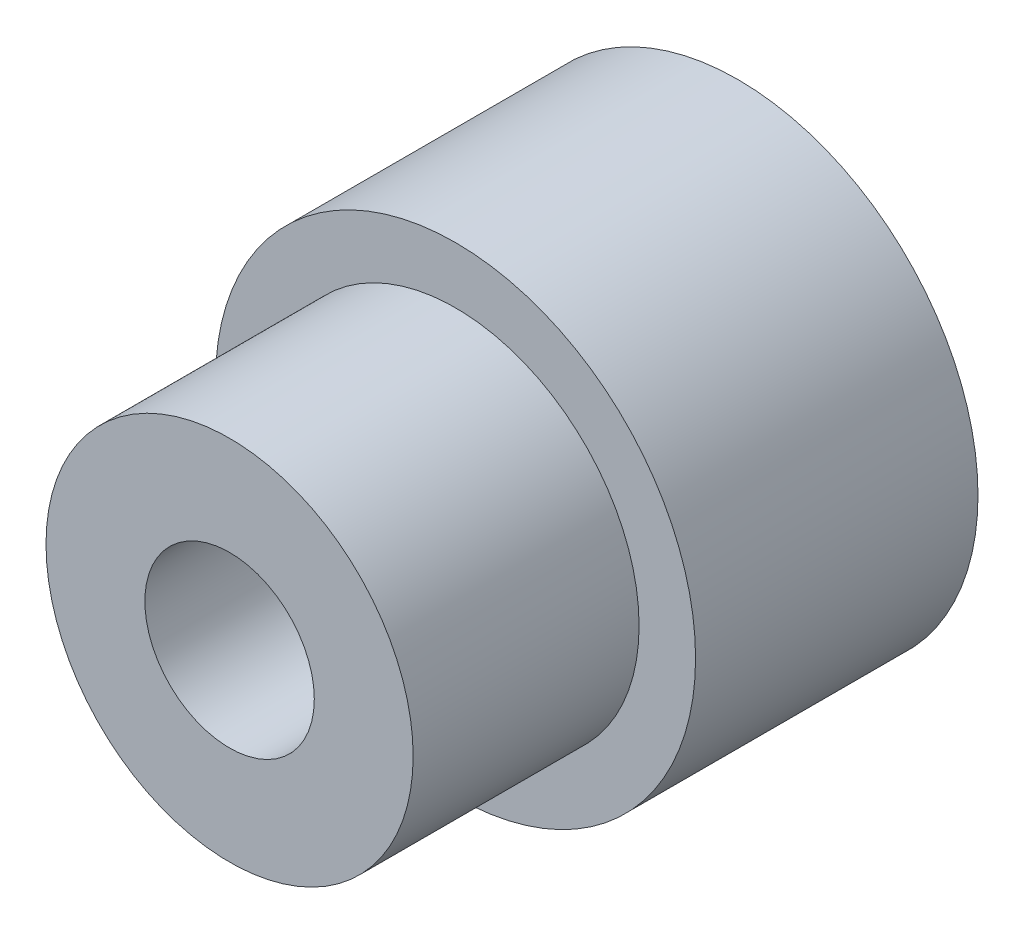
ISO-10303-21;
HEADER;
FILE_DESCRIPTION(('STEP AP214'),'2;1');
FILE_NAME('part.step','',(''),(''),'','','');
FILE_SCHEMA(('AUTOMOTIVE_DESIGN { 1 0 10303 214 1 1 1 1 }'));
ENDSEC;
DATA;
#1=APPLICATION_CONTEXT('core data for automotive mechanical design processes');
#2=APPLICATION_PROTOCOL_DEFINITION('international standard','automotive_design',2000,#1);
#3=PRODUCT_CONTEXT('',#1,'mechanical');
#4=PRODUCT('Part','Part','',(#3));
#5=PRODUCT_RELATED_PRODUCT_CATEGORY('part','',(#4));
#6=PRODUCT_DEFINITION_FORMATION('','',#4);
#7=PRODUCT_DEFINITION_CONTEXT('part definition',#1,'design');
#8=PRODUCT_DEFINITION('design','',#6,#7);
#9=PRODUCT_DEFINITION_SHAPE('','',#8);
#10=(LENGTH_UNIT() NAMED_UNIT(*) SI_UNIT(.MILLI.,.METRE.));
#11=(NAMED_UNIT(*) PLANE_ANGLE_UNIT() SI_UNIT($,.RADIAN.));
#12=(NAMED_UNIT(*) SI_UNIT($,.STERADIAN.) SOLID_ANGLE_UNIT());
#13=UNCERTAINTY_MEASURE_WITH_UNIT(LENGTH_MEASURE(1.E-05),#10,'distance_accuracy_value','');
#14=(GEOMETRIC_REPRESENTATION_CONTEXT(3) GLOBAL_UNCERTAINTY_ASSIGNED_CONTEXT((#13)) GLOBAL_UNIT_ASSIGNED_CONTEXT((#10,
#11,#12)) REPRESENTATION_CONTEXT('',''));
#15=CARTESIAN_POINT('',(0.,0.,0.));
#16=DIRECTION('',(0.,0.,1.));
#17=DIRECTION('',(1.,0.,0.));
#18=AXIS2_PLACEMENT_3D('',#15,#16,#17);
#19=CARTESIAN_POINT('',(0.,0.,10.));
#20=DIRECTION('',(0.,0.,-1.));
#21=DIRECTION('',(-1.,0.,0.));
#22=AXIS2_PLACEMENT_3D('',#19,#20,#21);
#23=CYLINDRICAL_SURFACE('',#22,8.5);
#24=CARTESIAN_POINT('',(0.,0.,10.));
#25=DIRECTION('',(0.,0.,1.));
#26=DIRECTION('',(1.,0.,0.));
#27=AXIS2_PLACEMENT_3D('',#24,#25,#26);
#28=CIRCLE('',#27,8.5);
#29=CARTESIAN_POINT('',(8.5,0.,10.));
#30=VERTEX_POINT('',#29);
#31=EDGE_CURVE('E10',#30,#30,#28,.T.);
#32=ORIENTED_EDGE('',*,*,#31,.F.);
#33=EDGE_LOOP('',(#32));
#34=FACE_BOUND('',#33,.T.);
#35=CARTESIAN_POINT('',(0.,0.,0.));
#36=DIRECTION('',(0.,0.,1.));
#37=DIRECTION('',(1.,0.,0.));
#38=AXIS2_PLACEMENT_3D('',#35,#36,#37);
#39=CIRCLE('',#38,8.5);
#40=CARTESIAN_POINT('',(8.5,0.,0.));
#41=VERTEX_POINT('',#40);
#42=EDGE_CURVE('E36',#41,#41,#39,.T.);
#43=ORIENTED_EDGE('',*,*,#42,.T.);
#44=EDGE_LOOP('',(#43));
#45=FACE_BOUND('',#44,.T.);
#46=ADVANCED_FACE('F33',(#34,#45),#23,.T.);
#47=CARTESIAN_POINT('',(0.,0.,10.));
#48=DIRECTION('',(0.,0.,1.));
#49=DIRECTION('',(1.,0.,0.));
#50=AXIS2_PLACEMENT_3D('',#47,#48,#49);
#51=PLANE('',#50);
#52=CARTESIAN_POINT('',(0.,0.,10.));
#53=DIRECTION('',(0.,0.,1.));
#54=DIRECTION('',(1.,0.,0.));
#55=AXIS2_PLACEMENT_3D('',#52,#53,#54);
#56=CIRCLE('',#55,6.5);
#57=CARTESIAN_POINT('',(6.5,0.,10.));
#58=VERTEX_POINT('',#57);
#59=EDGE_CURVE('E45',#58,#58,#56,.T.);
#60=ORIENTED_EDGE('',*,*,#59,.F.);
#61=EDGE_LOOP('',(#60));
#62=FACE_BOUND('',#61,.T.);
#63=ORIENTED_EDGE('',*,*,#31,.T.);
#64=EDGE_LOOP('',(#63));
#65=FACE_BOUND('',#64,.T.);
#66=ADVANCED_FACE('F78',(#62,#65),#51,.T.);
#67=CARTESIAN_POINT('',(0.,0.,0.));
#68=DIRECTION('',(0.,0.,1.));
#69=DIRECTION('',(1.,0.,0.));
#70=AXIS2_PLACEMENT_3D('',#67,#68,#69);
#71=PLANE('',#70);
#72=CARTESIAN_POINT('',(0.,0.,0.));
#73=DIRECTION('',(0.,0.,1.));
#74=DIRECTION('',(1.,0.,0.));
#75=AXIS2_PLACEMENT_3D('',#72,#73,#74);
#76=CIRCLE('',#75,3.);
#77=CARTESIAN_POINT('',(3.,0.,0.));
#78=VERTEX_POINT('',#77);
#79=EDGE_CURVE('E48',#78,#78,#76,.T.);
#80=ORIENTED_EDGE('',*,*,#79,.T.);
#81=EDGE_LOOP('',(#80));
#82=FACE_BOUND('',#81,.T.);
#83=ORIENTED_EDGE('',*,*,#42,.F.);
#84=EDGE_LOOP('',(#83));
#85=FACE_BOUND('',#84,.T.);
#86=ADVANCED_FACE('F57',(#82,#85),#71,.F.);
#87=CARTESIAN_POINT('',(0.,0.,18.));
#88=DIRECTION('',(0.,0.,-1.));
#89=DIRECTION('',(-1.,0.,0.));
#90=AXIS2_PLACEMENT_3D('',#87,#88,#89);
#91=CYLINDRICAL_SURFACE('',#90,6.5);
#92=CARTESIAN_POINT('',(0.,0.,18.));
#93=DIRECTION('',(0.,0.,1.));
#94=DIRECTION('',(1.,0.,0.));
#95=AXIS2_PLACEMENT_3D('',#92,#93,#94);
#96=CIRCLE('',#95,6.5);
#97=CARTESIAN_POINT('',(6.5,0.,18.));
#98=VERTEX_POINT('',#97);
#99=EDGE_CURVE('E43',#98,#98,#96,.T.);
#100=ORIENTED_EDGE('',*,*,#99,.F.);
#101=EDGE_LOOP('',(#100));
#102=FACE_BOUND('',#101,.T.);
#103=ORIENTED_EDGE('',*,*,#59,.T.);
#104=EDGE_LOOP('',(#103));
#105=FACE_BOUND('',#104,.T.);
#106=ADVANCED_FACE('F69',(#102,#105),#91,.T.);
#107=CARTESIAN_POINT('',(0.,0.,18.));
#108=DIRECTION('',(0.,0.,1.));
#109=DIRECTION('',(1.,0.,0.));
#110=AXIS2_PLACEMENT_3D('',#107,#108,#109);
#111=PLANE('',#110);
#112=CARTESIAN_POINT('',(0.,0.,18.));
#113=DIRECTION('',(0.,0.,1.));
#114=DIRECTION('',(1.,0.,0.));
#115=AXIS2_PLACEMENT_3D('',#112,#113,#114);
#116=CIRCLE('',#115,3.);
#117=CARTESIAN_POINT('',(3.,0.,18.));
#118=VERTEX_POINT('',#117);
#119=EDGE_CURVE('E51',#118,#118,#116,.T.);
#120=ORIENTED_EDGE('',*,*,#119,.F.);
#121=EDGE_LOOP('',(#120));
#122=FACE_BOUND('',#121,.T.);
#123=ORIENTED_EDGE('',*,*,#99,.T.);
#124=EDGE_LOOP('',(#123));
#125=FACE_BOUND('',#124,.T.);
#126=ADVANCED_FACE('F63',(#122,#125),#111,.T.);
#127=CARTESIAN_POINT('',(0.,0.,0.));
#128=DIRECTION('',(0.,0.,1.));
#129=DIRECTION('',(1.,0.,0.));
#130=AXIS2_PLACEMENT_3D('',#127,#128,#129);
#131=CYLINDRICAL_SURFACE('',#130,3.);
#132=ORIENTED_EDGE('',*,*,#79,.F.);
#133=EDGE_LOOP('',(#132));
#134=FACE_BOUND('',#133,.T.);
#135=ORIENTED_EDGE('',*,*,#119,.T.);
#136=EDGE_LOOP('',(#135));
#137=FACE_BOUND('',#136,.T.);
#138=ADVANCED_FACE('F60',(#134,#137),#131,.F.);
#139=CLOSED_SHELL('',(#46,#66,#86,#106,#126,#138));
#140=MANIFOLD_SOLID_BREP('B2',#139);
#141=ADVANCED_BREP_SHAPE_REPRESENTATION('',(#18,#140),#14);
#142=SHAPE_DEFINITION_REPRESENTATION(#9,#141);
ENDSEC;
END-ISO-10303-21;
